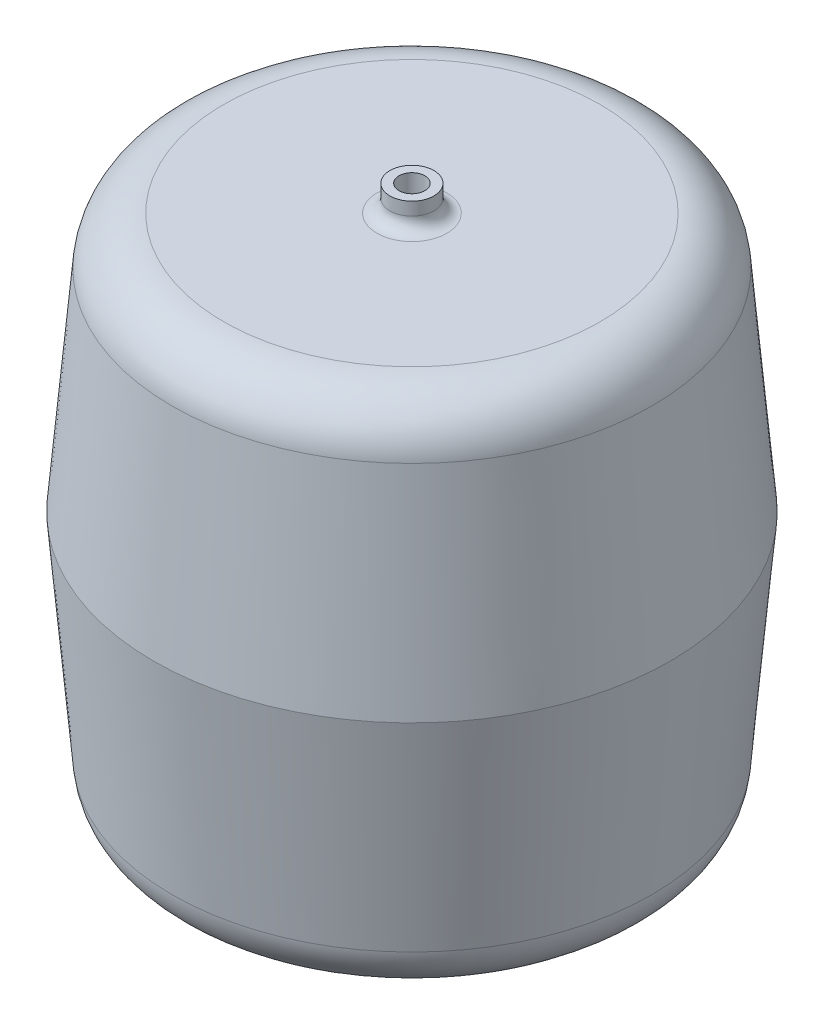
ISO-10303-21;
HEADER;
FILE_DESCRIPTION(('STEP AP214'),'2;1');
FILE_NAME('part.step','',(''),(''),'','','');
FILE_SCHEMA(('AUTOMOTIVE_DESIGN { 1 0 10303 214 1 1 1 1 }'));
ENDSEC;
DATA;
#1=APPLICATION_CONTEXT('core data for automotive mechanical design processes');
#2=APPLICATION_PROTOCOL_DEFINITION('international standard','automotive_design',2000,#1);
#3=PRODUCT_CONTEXT('',#1,'mechanical');
#4=PRODUCT('Part','Part','',(#3));
#5=PRODUCT_RELATED_PRODUCT_CATEGORY('part','',(#4));
#6=PRODUCT_DEFINITION_FORMATION('','',#4);
#7=PRODUCT_DEFINITION_CONTEXT('part definition',#1,'design');
#8=PRODUCT_DEFINITION('design','',#6,#7);
#9=PRODUCT_DEFINITION_SHAPE('','',#8);
#10=(LENGTH_UNIT() NAMED_UNIT(*) SI_UNIT(.MILLI.,.METRE.));
#11=(NAMED_UNIT(*) PLANE_ANGLE_UNIT() SI_UNIT($,.RADIAN.));
#12=(NAMED_UNIT(*) SI_UNIT($,.STERADIAN.) SOLID_ANGLE_UNIT());
#13=UNCERTAINTY_MEASURE_WITH_UNIT(LENGTH_MEASURE(1.E-05),#10,'distance_accuracy_value','');
#14=(GEOMETRIC_REPRESENTATION_CONTEXT(3) GLOBAL_UNCERTAINTY_ASSIGNED_CONTEXT((#13)) GLOBAL_UNIT_ASSIGNED_CONTEXT((#10,
#11,#12)) REPRESENTATION_CONTEXT('',''));
#15=CARTESIAN_POINT('',(0.,0.,0.));
#16=DIRECTION('',(0.,0.,1.));
#17=DIRECTION('',(1.,0.,0.));
#18=AXIS2_PLACEMENT_3D('',#15,#16,#17);
#19=CARTESIAN_POINT('',(219.632473554395,495.3,0.));
#20=DIRECTION('',(0.,1.,0.));
#21=DIRECTION('',(0.,0.,1.));
#22=AXIS2_PLACEMENT_3D('',#19,#20,#21);
#23=PLANE('',#22);
#24=CARTESIAN_POINT('',(0.,495.3,0.));
#25=DIRECTION('',(0.,1.,0.));
#26=DIRECTION('',(0.,0.,1.));
#27=AXIS2_PLACEMENT_3D('',#24,#25,#26);
#28=CIRCLE('',#27,173.082849914309);
#29=CARTESIAN_POINT('',(0.,495.3,173.082849914309));
#30=VERTEX_POINT('',#29);
#31=EDGE_CURVE('E44',#30,#30,#28,.F.);
#32=ORIENTED_EDGE('',*,*,#31,.T.);
#33=EDGE_LOOP('',(#32));
#34=FACE_BOUND('',#33,.T.);
#35=CARTESIAN_POINT('',(0.,495.3,0.));
#36=DIRECTION('',(0.,1.,0.));
#37=DIRECTION('',(0.,0.,1.));
#38=AXIS2_PLACEMENT_3D('',#35,#36,#37);
#39=CIRCLE('',#38,12.7);
#40=CARTESIAN_POINT('',(0.,495.3,12.7));
#41=VERTEX_POINT('',#40);
#42=EDGE_CURVE('E86',#41,#41,#39,.T.);
#43=ORIENTED_EDGE('',*,*,#42,.T.);
#44=EDGE_LOOP('',(#43));
#45=FACE_BOUND('',#44,.T.);
#46=ADVANCED_FACE('F33',(#34,#45),#23,.F.);
#47=CARTESIAN_POINT('',(0.,495.3,0.));
#48=DIRECTION('',(0.,-1.,0.));
#49=DIRECTION('',(0.,0.,-1.));
#50=AXIS2_PLACEMENT_3D('',#47,#48,#49);
#51=CONICAL_SURFACE('',#50,219.632473554395,0.0872664625997133);
#52=CARTESIAN_POINT('',(0.,448.927511731581,0.));
#53=DIRECTION('',(0.,-1.,0.));
#54=DIRECTION('',(0.,0.,-1.));
#55=AXIS2_PLACEMENT_3D('',#52,#53,#54);
#56=CIRCLE('',#55,223.68954057737);
#57=CARTESIAN_POINT('',(0.,448.927511731581,-223.68954057737));
#58=VERTEX_POINT('',#57);
#59=EDGE_CURVE('E48',#58,#58,#56,.F.);
#60=ORIENTED_EDGE('',*,*,#59,.T.);
#61=EDGE_LOOP('',(#60));
#62=FACE_BOUND('',#61,.T.);
#63=CARTESIAN_POINT('',(0.,254.,0.));
#64=DIRECTION('',(0.,1.,0.));
#65=DIRECTION('',(0.,0.,1.));
#66=AXIS2_PLACEMENT_3D('',#63,#64,#65);
#67=CIRCLE('',#66,240.743488063199);
#68=CARTESIAN_POINT('',(0.,254.,240.743488063199));
#69=VERTEX_POINT('',#68);
#70=EDGE_CURVE('E77',#69,#69,#67,.T.);
#71=ORIENTED_EDGE('',*,*,#70,.F.);
#72=EDGE_LOOP('',(#71));
#73=FACE_BOUND('',#72,.T.);
#74=ADVANCED_FACE('F121',(#62,#73),#51,.F.);
#75=CARTESIAN_POINT('',(0.,254.,0.));
#76=DIRECTION('',(0.,1.,0.));
#77=DIRECTION('',(0.,0.,1.));
#78=AXIS2_PLACEMENT_3D('',#75,#76,#77);
#79=CONICAL_SURFACE('',#78,240.743488063199,0.0872664625997126);
#80=CARTESIAN_POINT('',(0.,59.0724882684192,0.));
#81=DIRECTION('',(0.,1.,0.));
#82=DIRECTION('',(0.,0.,1.));
#83=AXIS2_PLACEMENT_3D('',#80,#81,#82);
#84=CIRCLE('',#83,223.68954057737);
#85=CARTESIAN_POINT('',(0.,59.0724882684192,223.68954057737));
#86=VERTEX_POINT('',#85);
#87=EDGE_CURVE('E10',#86,#86,#84,.F.);
#88=ORIENTED_EDGE('',*,*,#87,.T.);
#89=EDGE_LOOP('',(#88));
#90=FACE_BOUND('',#89,.T.);
#91=ORIENTED_EDGE('',*,*,#70,.T.);
#92=EDGE_LOOP('',(#91));
#93=FACE_BOUND('',#92,.T.);
#94=ADVANCED_FACE('F127',(#90,#93),#79,.F.);
#95=CARTESIAN_POINT('',(0.,12.7,0.));
#96=DIRECTION('',(0.,-1.,0.));
#97=DIRECTION('',(0.,0.,-1.));
#98=AXIS2_PLACEMENT_3D('',#95,#96,#97);
#99=PLANE('',#98);
#100=CARTESIAN_POINT('',(0.,12.7,0.));
#101=DIRECTION('',(0.,-1.,0.));
#102=DIRECTION('',(0.,0.,-1.));
#103=AXIS2_PLACEMENT_3D('',#100,#101,#102);
#104=CIRCLE('',#103,173.08284991431);
#105=CARTESIAN_POINT('',(0.,12.7,-173.08284991431));
#106=VERTEX_POINT('',#105);
#107=EDGE_CURVE('E40',#106,#106,#104,.F.);
#108=ORIENTED_EDGE('',*,*,#107,.T.);
#109=EDGE_LOOP('',(#108));
#110=FACE_BOUND('',#109,.T.);
#111=ADVANCED_FACE('F98',(#110),#99,.F.);
#112=CARTESIAN_POINT('',(0.,495.3,0.));
#113=DIRECTION('',(0.,1.,0.));
#114=DIRECTION('',(0.,0.,1.));
#115=AXIS2_PLACEMENT_3D('',#112,#113,#114);
#116=CYLINDRICAL_SURFACE('',#115,12.7);
#117=CARTESIAN_POINT('',(0.,533.4,0.));
#118=DIRECTION('',(0.,1.,0.));
#119=DIRECTION('',(0.,0.,1.));
#120=AXIS2_PLACEMENT_3D('',#117,#118,#119);
#121=CIRCLE('',#120,12.7);
#122=CARTESIAN_POINT('',(0.,533.4,12.7));
#123=VERTEX_POINT('',#122);
#124=EDGE_CURVE('E87',#123,#123,#121,.T.);
#125=CARTESIAN_POINT('',(0.,495.3,12.7));
#126=CARTESIAN_POINT('',(0.,495.696875,12.7));
#127=CARTESIAN_POINT('',(0.,496.09375,12.7));
#128=CARTESIAN_POINT('',(0.,496.8875,12.7));
#129=CARTESIAN_POINT('',(0.,497.284375,12.7));
#130=CARTESIAN_POINT('',(0.,498.078125,12.7));
#131=CARTESIAN_POINT('',(0.,498.475,12.7));
#132=CARTESIAN_POINT('',(0.,499.26875,12.7));
#133=CARTESIAN_POINT('',(0.,499.665625,12.7));
#134=CARTESIAN_POINT('',(0.,500.459375,12.7));
#135=CARTESIAN_POINT('',(0.,500.85625,12.7));
#136=CARTESIAN_POINT('',(0.,501.65,12.7));
#137=CARTESIAN_POINT('',(0.,502.046875,12.7));
#138=CARTESIAN_POINT('',(0.,502.840625,12.7));
#139=CARTESIAN_POINT('',(0.,503.2375,12.7));
#140=CARTESIAN_POINT('',(0.,504.03125,12.7));
#141=CARTESIAN_POINT('',(0.,504.428125,12.7));
#142=CARTESIAN_POINT('',(0.,505.221875,12.7));
#143=CARTESIAN_POINT('',(0.,505.61875,12.7));
#144=CARTESIAN_POINT('',(0.,506.4125,12.7));
#145=CARTESIAN_POINT('',(0.,506.809375,12.7));
#146=CARTESIAN_POINT('',(0.,507.603125,12.7));
#147=CARTESIAN_POINT('',(0.,508.,12.7));
#148=CARTESIAN_POINT('',(0.,508.79375,12.7));
#149=CARTESIAN_POINT('',(0.,509.190625,12.7));
#150=CARTESIAN_POINT('',(0.,509.984375,12.7));
#151=CARTESIAN_POINT('',(0.,510.38125,12.7));
#152=CARTESIAN_POINT('',(0.,511.175,12.7));
#153=CARTESIAN_POINT('',(0.,511.571875,12.7));
#154=CARTESIAN_POINT('',(0.,512.365625,12.7));
#155=CARTESIAN_POINT('',(0.,512.7625,12.7));
#156=CARTESIAN_POINT('',(0.,513.55625,12.7));
#157=CARTESIAN_POINT('',(0.,513.953125,12.7));
#158=CARTESIAN_POINT('',(0.,514.746875,12.7));
#159=CARTESIAN_POINT('',(0.,515.14375,12.7));
#160=CARTESIAN_POINT('',(0.,515.9375,12.7));
#161=CARTESIAN_POINT('',(0.,516.334375,12.7));
#162=CARTESIAN_POINT('',(0.,517.128125,12.7));
#163=CARTESIAN_POINT('',(0.,517.525,12.7));
#164=CARTESIAN_POINT('',(0.,518.31875,12.7));
#165=CARTESIAN_POINT('',(0.,518.715625,12.7));
#166=CARTESIAN_POINT('',(0.,519.509375,12.7));
#167=CARTESIAN_POINT('',(0.,519.90625,12.7));
#168=CARTESIAN_POINT('',(0.,520.7,12.7));
#169=CARTESIAN_POINT('',(0.,521.096875,12.7));
#170=CARTESIAN_POINT('',(0.,521.890625,12.7));
#171=CARTESIAN_POINT('',(0.,522.2875,12.7));
#172=CARTESIAN_POINT('',(0.,523.08125,12.7));
#173=CARTESIAN_POINT('',(0.,523.478125,12.7));
#174=CARTESIAN_POINT('',(0.,524.271875,12.7));
#175=CARTESIAN_POINT('',(0.,524.66875,12.7));
#176=CARTESIAN_POINT('',(0.,525.4625,12.7));
#177=CARTESIAN_POINT('',(0.,525.859375,12.7));
#178=CARTESIAN_POINT('',(0.,526.653125,12.7));
#179=CARTESIAN_POINT('',(0.,527.05,12.7));
#180=CARTESIAN_POINT('',(0.,527.84375,12.7));
#181=CARTESIAN_POINT('',(0.,528.240625,12.7));
#182=CARTESIAN_POINT('',(0.,529.034375,12.7));
#183=CARTESIAN_POINT('',(0.,529.43125,12.7));
#184=CARTESIAN_POINT('',(0.,530.225,12.7));
#185=CARTESIAN_POINT('',(0.,530.621875,12.7));
#186=CARTESIAN_POINT('',(0.,531.415625,12.7));
#187=CARTESIAN_POINT('',(0.,531.8125,12.7));
#188=CARTESIAN_POINT('',(0.,532.60625,12.7));
#189=CARTESIAN_POINT('',(0.,533.003125,12.7));
#190=CARTESIAN_POINT('',(0.,533.4,12.7));
#191=B_SPLINE_CURVE_WITH_KNOTS('',3,(#125,#126,#127,#128,#129,#130,#131,#132,#133,#134,#135,
#136,#137,#138,#139,#140,#141,#142,#143,#144,#145,#146,#147,#148,#149,#150,#151,#152,#153,#154,
#155,#156,#157,#158,#159,#160,#161,#162,#163,#164,#165,#166,#167,#168,#169,#170,#171,#172,#173,
#174,#175,#176,#177,#178,#179,#180,#181,#182,#183,#184,#185,#186,#187,#188,#189,#190),
.UNSPECIFIED.,.F.,.F.,(4,2,2,2,2,2,2,2,2,2,2,2,2,2,2,2,2,2,2,2,2,2,2,2,2,2,2,2,2,2,2,2,4),(0.,
1.19062499999995,2.38124999999995,3.57187499999995,4.7625,5.953125,7.14375,8.334375,
9.52500000000001,10.715625,11.90625,13.096875,14.2875,15.478125,16.66875,17.859375,19.05,
20.240625,21.43125,22.621875,23.8125,25.003125,26.19375,27.384375,28.575,29.765625,30.95625,
32.146875,33.3375,34.528125,35.71875,36.909375,38.1),.UNSPECIFIED.);
#192=EDGE_CURVE('BSEAM94',#41,#123,#191,.T.);
#193=ORIENTED_EDGE('',*,*,#42,.F.);
#194=ORIENTED_EDGE('',*,*,#124,.T.);
#195=ORIENTED_EDGE('',*,*,#192,.T.);
#196=ORIENTED_EDGE('',*,*,#192,.F.);
#197=EDGE_LOOP('',(#193,#195,#194,#196));
#198=FACE_BOUND('',#197,.T.);
#199=ADVANCED_FACE('F94',(#198),#116,.F.);
#200=CARTESIAN_POINT('',(0.,0.,0.));
#201=DIRECTION('',(0.,1.,0.));
#202=DIRECTION('',(0.,0.,1.));
#203=AXIS2_PLACEMENT_3D('',#200,#201,#202);
#204=PLANE('',#203);
#205=CARTESIAN_POINT('',(0.,0.,0.));
#206=DIRECTION('',(0.,1.,0.));
#207=DIRECTION('',(0.,0.,1.));
#208=AXIS2_PLACEMENT_3D('',#205,#206,#207);
#209=CIRCLE('',#208,126.746);
#210=CARTESIAN_POINT('',(0.,0.,126.746));
#211=VERTEX_POINT('',#210);
#212=EDGE_CURVE('E59',#211,#211,#209,.F.);
#213=ORIENTED_EDGE('',*,*,#212,.F.);
#214=EDGE_LOOP('',(#213));
#215=FACE_BOUND('',#214,.T.);
#216=CARTESIAN_POINT('',(0.,0.,0.));
#217=DIRECTION('',(0.,1.,0.));
#218=DIRECTION('',(0.,0.,1.));
#219=AXIS2_PLACEMENT_3D('',#216,#217,#218);
#220=CIRCLE('',#219,184.720255824331);
#221=CARTESIAN_POINT('',(0.,0.,184.720255824331));
#222=VERTEX_POINT('',#221);
#223=EDGE_CURVE('E68',#222,#222,#220,.F.);
#224=ORIENTED_EDGE('',*,*,#223,.T.);
#225=EDGE_LOOP('',(#224));
#226=FACE_BOUND('',#225,.T.);
#227=ADVANCED_FACE('F97',(#215,#226),#204,.F.);
#228=CARTESIAN_POINT('',(0.,0.,0.));
#229=DIRECTION('',(0.,1.,0.));
#230=DIRECTION('',(0.,0.,1.));
#231=AXIS2_PLACEMENT_3D('',#228,#229,#230);
#232=CONICAL_SURFACE('',#231,231.269879464416,0.0872664625997127);
#233=CARTESIAN_POINT('',(0.,46.3724882684189,0.));
#234=DIRECTION('',(0.,-1.,0.));
#235=DIRECTION('',(0.,0.,-1.));
#236=AXIS2_PLACEMENT_3D('',#233,#234,#235);
#237=CIRCLE('',#236,235.326946487392);
#238=CARTESIAN_POINT('',(0.,46.3724882684189,-235.326946487392));
#239=VERTEX_POINT('',#238);
#240=EDGE_CURVE('E71',#239,#239,#237,.F.);
#241=ORIENTED_EDGE('',*,*,#240,.T.);
#242=EDGE_LOOP('',(#241));
#243=FACE_BOUND('',#242,.T.);
#244=CARTESIAN_POINT('',(0.,254.,0.));
#245=DIRECTION('',(0.,1.,0.));
#246=DIRECTION('',(0.,0.,1.));
#247=AXIS2_PLACEMENT_3D('',#244,#245,#246);
#248=CIRCLE('',#247,253.492);
#249=CARTESIAN_POINT('',(0.,254.,253.492));
#250=VERTEX_POINT('',#249);
#251=EDGE_CURVE('E74',#250,#250,#248,.T.);
#252=ORIENTED_EDGE('',*,*,#251,.F.);
#253=EDGE_LOOP('',(#252));
#254=FACE_BOUND('',#253,.T.);
#255=ADVANCED_FACE('F140',(#243,#254),#232,.T.);
#256=CARTESIAN_POINT('',(0.,254.,0.));
#257=DIRECTION('',(0.,-1.,0.));
#258=DIRECTION('',(0.,0.,-1.));
#259=AXIS2_PLACEMENT_3D('',#256,#257,#258);
#260=CONICAL_SURFACE('',#259,253.492,0.0872664625997132);
#261=CARTESIAN_POINT('',(0.,461.627511731581,0.));
#262=DIRECTION('',(0.,1.,0.));
#263=DIRECTION('',(0.,0.,1.));
#264=AXIS2_PLACEMENT_3D('',#261,#262,#263);
#265=CIRCLE('',#264,235.326946487392);
#266=CARTESIAN_POINT('',(0.,461.627511731581,235.326946487392));
#267=VERTEX_POINT('',#266);
#268=EDGE_CURVE('E62',#267,#267,#265,.F.);
#269=ORIENTED_EDGE('',*,*,#268,.T.);
#270=EDGE_LOOP('',(#269));
#271=FACE_BOUND('',#270,.T.);
#272=ORIENTED_EDGE('',*,*,#251,.T.);
#273=EDGE_LOOP('',(#272));
#274=FACE_BOUND('',#273,.T.);
#275=ADVANCED_FACE('F136',(#271,#274),#260,.T.);
#276=CARTESIAN_POINT('',(231.269879464416,508.,0.));
#277=DIRECTION('',(0.,-1.,0.));
#278=DIRECTION('',(0.,0.,-1.));
#279=AXIS2_PLACEMENT_3D('',#276,#277,#278);
#280=PLANE('',#279);
#281=CARTESIAN_POINT('',(0.,508.,0.));
#282=DIRECTION('',(0.,-1.,0.));
#283=DIRECTION('',(0.,0.,-1.));
#284=AXIS2_PLACEMENT_3D('',#281,#282,#283);
#285=CIRCLE('',#284,34.29);
#286=CARTESIAN_POINT('',(0.,508.,-34.29));
#287=VERTEX_POINT('',#286);
#288=EDGE_CURVE('E53',#287,#287,#285,.T.);
#289=ORIENTED_EDGE('',*,*,#288,.T.);
#290=EDGE_LOOP('',(#289));
#291=FACE_BOUND('',#290,.T.);
#292=CARTESIAN_POINT('',(0.,508.,0.));
#293=DIRECTION('',(0.,-1.,0.));
#294=DIRECTION('',(0.,0.,-1.));
#295=AXIS2_PLACEMENT_3D('',#292,#293,#294);
#296=CIRCLE('',#295,184.720255824331);
#297=CARTESIAN_POINT('',(0.,508.,-184.720255824331));
#298=VERTEX_POINT('',#297);
#299=EDGE_CURVE('E65',#298,#298,#296,.F.);
#300=ORIENTED_EDGE('',*,*,#299,.T.);
#301=EDGE_LOOP('',(#300));
#302=FACE_BOUND('',#301,.T.);
#303=ADVANCED_FACE('F132',(#291,#302),#280,.F.);
#304=CARTESIAN_POINT('',(0.,50.8,0.));
#305=DIRECTION('',(0.,1.,0.));
#306=DIRECTION('',(0.,0.,1.));
#307=AXIS2_PLACEMENT_3D('',#304,#305,#306);
#308=TOROIDAL_SURFACE('',#307,184.720255824331,50.8);
#309=ORIENTED_EDGE('',*,*,#223,.F.);
#310=EDGE_LOOP('',(#309));
#311=FACE_BOUND('',#310,.T.);
#312=ORIENTED_EDGE('',*,*,#240,.F.);
#313=EDGE_LOOP('',(#312));
#314=FACE_BOUND('',#313,.T.);
#315=ADVANCED_FACE('F135',(#311,#314),#308,.T.);
#316=CARTESIAN_POINT('',(0.,457.2,0.));
#317=DIRECTION('',(0.,-1.,0.));
#318=DIRECTION('',(0.,0.,-1.));
#319=AXIS2_PLACEMENT_3D('',#316,#317,#318);
#320=TOROIDAL_SURFACE('',#319,184.720255824331,50.8);
#321=ORIENTED_EDGE('',*,*,#268,.F.);
#322=EDGE_LOOP('',(#321));
#323=FACE_BOUND('',#322,.T.);
#324=ORIENTED_EDGE('',*,*,#299,.F.);
#325=EDGE_LOOP('',(#324));
#326=FACE_BOUND('',#325,.T.);
#327=ADVANCED_FACE('F150',(#323,#326),#320,.T.);
#328=CARTESIAN_POINT('',(0.,-25.4,0.));
#329=DIRECTION('',(0.,1.,0.));
#330=DIRECTION('',(0.,0.,1.));
#331=AXIS2_PLACEMENT_3D('',#328,#329,#330);
#332=CYLINDRICAL_SURFACE('',#331,126.746);
#333=CARTESIAN_POINT('',(0.,-25.4,0.));
#334=DIRECTION('',(0.,-1.,0.));
#335=DIRECTION('',(0.,0.,-1.));
#336=AXIS2_PLACEMENT_3D('',#333,#334,#335);
#337=CIRCLE('',#336,126.746);
#338=CARTESIAN_POINT('',(0.,-25.4,-126.746));
#339=VERTEX_POINT('',#338);
#340=EDGE_CURVE('E80',#339,#339,#337,.T.);
#341=ORIENTED_EDGE('',*,*,#340,.F.);
#342=EDGE_LOOP('',(#341));
#343=FACE_BOUND('',#342,.T.);
#344=ORIENTED_EDGE('',*,*,#212,.T.);
#345=EDGE_LOOP('',(#344));
#346=FACE_BOUND('',#345,.T.);
#347=ADVANCED_FACE('F117',(#343,#346),#332,.T.);
#348=CARTESIAN_POINT('',(0.,-25.4,0.));
#349=DIRECTION('',(0.,-1.,0.));
#350=DIRECTION('',(0.,0.,-1.));
#351=AXIS2_PLACEMENT_3D('',#348,#349,#350);
#352=PLANE('',#351);
#353=ORIENTED_EDGE('',*,*,#340,.T.);
#354=EDGE_LOOP('',(#353));
#355=FACE_BOUND('',#354,.T.);
#356=ADVANCED_FACE('F111',(#355),#352,.T.);
#357=CARTESIAN_POINT('',(0.,533.4,0.));
#358=DIRECTION('',(0.,-1.,0.));
#359=DIRECTION('',(0.,0.,-1.));
#360=AXIS2_PLACEMENT_3D('',#357,#358,#359);
#361=CYLINDRICAL_SURFACE('',#360,21.59);
#362=CARTESIAN_POINT('',(0.,520.7,0.));
#363=DIRECTION('',(0.,-1.,0.));
#364=DIRECTION('',(0.,0.,-1.));
#365=AXIS2_PLACEMENT_3D('',#362,#363,#364);
#366=CIRCLE('',#365,21.59);
#367=CARTESIAN_POINT('',(0.,520.7,-21.59));
#368=VERTEX_POINT('',#367);
#369=EDGE_CURVE('E56',#368,#368,#366,.F.);
#370=ORIENTED_EDGE('',*,*,#369,.T.);
#371=EDGE_LOOP('',(#370));
#372=FACE_BOUND('',#371,.T.);
#373=CARTESIAN_POINT('',(0.,533.4,0.));
#374=DIRECTION('',(0.,1.,0.));
#375=DIRECTION('',(0.,0.,1.));
#376=AXIS2_PLACEMENT_3D('',#373,#374,#375);
#377=CIRCLE('',#376,21.59);
#378=CARTESIAN_POINT('',(0.,533.4,21.59));
#379=VERTEX_POINT('',#378);
#380=EDGE_CURVE('E83',#379,#379,#377,.T.);
#381=ORIENTED_EDGE('',*,*,#380,.F.);
#382=EDGE_LOOP('',(#381));
#383=FACE_BOUND('',#382,.T.);
#384=ADVANCED_FACE('F106',(#372,#383),#361,.T.);
#385=CARTESIAN_POINT('',(0.,533.4,0.));
#386=DIRECTION('',(0.,1.,0.));
#387=DIRECTION('',(0.,0.,1.));
#388=AXIS2_PLACEMENT_3D('',#385,#386,#387);
#389=PLANE('',#388);
#390=ORIENTED_EDGE('',*,*,#124,.F.);
#391=EDGE_LOOP('',(#390));
#392=FACE_BOUND('',#391,.T.);
#393=ORIENTED_EDGE('',*,*,#380,.T.);
#394=EDGE_LOOP('',(#393));
#395=FACE_BOUND('',#394,.T.);
#396=ADVANCED_FACE('F102',(#392,#395),#389,.T.);
#397=CARTESIAN_POINT('',(0.,520.7,0.));
#398=DIRECTION('',(0.,-1.,0.));
#399=DIRECTION('',(0.,0.,-1.));
#400=AXIS2_PLACEMENT_3D('',#397,#398,#399);
#401=TOROIDAL_SURFACE('',#400,34.29,12.7);
#402=ORIENTED_EDGE('',*,*,#288,.F.);
#403=EDGE_LOOP('',(#402));
#404=FACE_BOUND('',#403,.T.);
#405=ORIENTED_EDGE('',*,*,#369,.F.);
#406=EDGE_LOOP('',(#405));
#407=FACE_BOUND('',#406,.T.);
#408=ADVANCED_FACE('F105',(#404,#407),#401,.F.);
#409=CARTESIAN_POINT('',(0.,444.5,0.));
#410=DIRECTION('',(0.,1.,0.));
#411=DIRECTION('',(0.,0.,1.));
#412=AXIS2_PLACEMENT_3D('',#409,#410,#411);
#413=TOROIDAL_SURFACE('',#412,173.082849914309,50.8);
#414=ORIENTED_EDGE('',*,*,#31,.F.);
#415=EDGE_LOOP('',(#414));
#416=FACE_BOUND('',#415,.T.);
#417=ORIENTED_EDGE('',*,*,#59,.F.);
#418=EDGE_LOOP('',(#417));
#419=FACE_BOUND('',#418,.T.);
#420=ADVANCED_FACE('F156',(#416,#419),#413,.F.);
#421=CARTESIAN_POINT('',(0.,63.5,0.));
#422=DIRECTION('',(0.,-1.,0.));
#423=DIRECTION('',(0.,0.,-1.));
#424=AXIS2_PLACEMENT_3D('',#421,#422,#423);
#425=TOROIDAL_SURFACE('',#424,173.08284991431,50.8);
#426=ORIENTED_EDGE('',*,*,#87,.F.);
#427=EDGE_LOOP('',(#426));
#428=FACE_BOUND('',#427,.T.);
#429=ORIENTED_EDGE('',*,*,#107,.F.);
#430=EDGE_LOOP('',(#429));
#431=FACE_BOUND('',#430,.T.);
#432=ADVANCED_FACE('F35',(#428,#431),#425,.F.);
#433=CLOSED_SHELL('',(#46,#74,#94,#111,#199,#227,#255,#275,#303,#315,#327,#347,#356,#384,#396,
#408,#420,#432));
#434=MANIFOLD_SOLID_BREP('B2',#433);
#435=ADVANCED_BREP_SHAPE_REPRESENTATION('',(#18,#434),#14);
#436=SHAPE_DEFINITION_REPRESENTATION(#9,#435);
ENDSEC;
END-ISO-10303-21;
